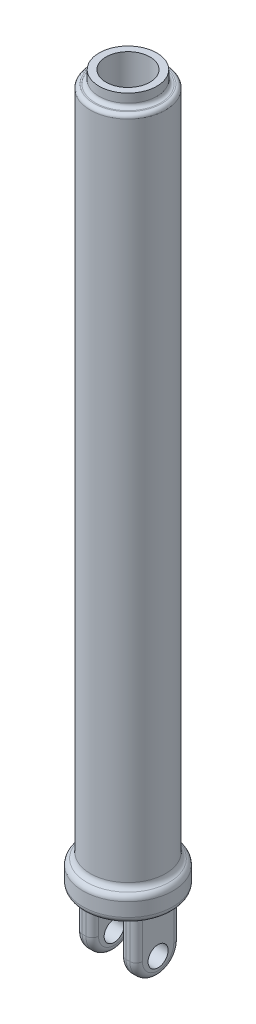
ISO-10303-21;
HEADER;
FILE_DESCRIPTION(('STEP AP214'),'2;1');
FILE_NAME('part.step','',(''),(''),'','','');
FILE_SCHEMA(('AUTOMOTIVE_DESIGN { 1 0 10303 214 1 1 1 1 }'));
ENDSEC;
DATA;
#1=APPLICATION_CONTEXT('core data for automotive mechanical design processes');
#2=APPLICATION_PROTOCOL_DEFINITION('international standard','automotive_design',2000,#1);
#3=PRODUCT_CONTEXT('',#1,'mechanical');
#4=PRODUCT('Part','Part','',(#3));
#5=PRODUCT_RELATED_PRODUCT_CATEGORY('part','',(#4));
#6=PRODUCT_DEFINITION_FORMATION('','',#4);
#7=PRODUCT_DEFINITION_CONTEXT('part definition',#1,'design');
#8=PRODUCT_DEFINITION('design','',#6,#7);
#9=PRODUCT_DEFINITION_SHAPE('','',#8);
#10=(LENGTH_UNIT() NAMED_UNIT(*) SI_UNIT(.MILLI.,.METRE.));
#11=(NAMED_UNIT(*) PLANE_ANGLE_UNIT() SI_UNIT($,.RADIAN.));
#12=(NAMED_UNIT(*) SI_UNIT($,.STERADIAN.) SOLID_ANGLE_UNIT());
#13=UNCERTAINTY_MEASURE_WITH_UNIT(LENGTH_MEASURE(1.E-05),#10,'distance_accuracy_value','');
#14=(GEOMETRIC_REPRESENTATION_CONTEXT(3) GLOBAL_UNCERTAINTY_ASSIGNED_CONTEXT((#13)) GLOBAL_UNIT_ASSIGNED_CONTEXT((#10,
#11,#12)) REPRESENTATION_CONTEXT('',''));
#15=CARTESIAN_POINT('',(0.,0.,0.));
#16=DIRECTION('',(0.,0.,1.));
#17=DIRECTION('',(1.,0.,0.));
#18=AXIS2_PLACEMENT_3D('',#15,#16,#17);
#19=CARTESIAN_POINT('',(18.9999999999999,-32.5,0.));
#20=DIRECTION('',(-1.,0.,0.));
#21=DIRECTION('',(0.,0.,1.));
#22=AXIS2_PLACEMENT_3D('',#19,#20,#21);
#23=TOROIDAL_SURFACE('',#22,12.5,5.);
#24=CARTESIAN_POINT('',(18.9999999999999,-32.5,12.4999999999999));
#25=DIRECTION('',(0.,1.,0.));
#26=DIRECTION('',(0.,0.,1.));
#27=AXIS2_PLACEMENT_3D('',#24,#25,#26);
#28=CIRCLE('',#27,4.99999999999997);
#29=CARTESIAN_POINT('',(18.9999999999999,-32.5,17.4999999999999));
#30=VERTEX_POINT('',#29);
#31=CARTESIAN_POINT('',(23.9999999999999,-32.5,12.4999999999999));
#32=VERTEX_POINT('',#31);
#33=EDGE_CURVE('E161',#30,#32,#28,.T.);
#34=ORIENTED_EDGE('',*,*,#33,.F.);
#35=CARTESIAN_POINT('',(18.9999999999999,-32.5,0.));
#36=DIRECTION('',(1.,0.,0.));
#37=DIRECTION('',(0.,0.,-1.));
#38=AXIS2_PLACEMENT_3D('',#35,#36,#37);
#39=CIRCLE('',#38,17.4999999999999);
#40=CARTESIAN_POINT('',(18.9999999999999,-32.5,-17.4999999999999));
#41=VERTEX_POINT('',#40);
#42=EDGE_CURVE('E531',#41,#30,#39,.F.);
#43=ORIENTED_EDGE('',*,*,#42,.F.);
#44=CARTESIAN_POINT('',(18.9999999999999,-32.5,-12.4999999999999));
#45=DIRECTION('',(0.,1.,0.));
#46=DIRECTION('',(0.,0.,1.));
#47=AXIS2_PLACEMENT_3D('',#44,#45,#46);
#48=CIRCLE('',#47,4.99999999999997);
#49=CARTESIAN_POINT('',(23.9999999999999,-32.5,-12.4999999999999));
#50=VERTEX_POINT('',#49);
#51=EDGE_CURVE('E556',#50,#41,#48,.T.);
#52=ORIENTED_EDGE('',*,*,#51,.F.);
#53=CARTESIAN_POINT('',(23.9999999999999,-32.5,0.));
#54=DIRECTION('',(-1.,0.,0.));
#55=DIRECTION('',(0.,0.,-1.));
#56=AXIS2_PLACEMENT_3D('',#53,#54,#55);
#57=CIRCLE('',#56,12.4999999999999);
#58=EDGE_CURVE('E164',#50,#32,#57,.T.);
#59=ORIENTED_EDGE('',*,*,#58,.T.);
#60=EDGE_LOOP('',(#34,#43,#52,#59));
#61=FACE_BOUND('',#60,.T.);
#62=ADVANCED_FACE('F16',(#61),#23,.T.);
#63=CARTESIAN_POINT('',(-35.8238545691087,-32.5,0.));
#64=DIRECTION('',(1.,0.,0.));
#65=DIRECTION('',(0.,0.,-1.));
#66=AXIS2_PLACEMENT_3D('',#63,#64,#65);
#67=CYLINDRICAL_SURFACE('',#66,17.4999999999999);
#68=DIRECTION('',(1.,0.,0.));
#69=VECTOR('',#68,1.);
#70=CARTESIAN_POINT('',(10.9999999999999,-32.5,17.4999999999999));
#71=LINE('',#70,#69);
#72=CARTESIAN_POINT('',(15.9999999999999,-32.5,17.4999999999999));
#73=VERTEX_POINT('',#72);
#74=EDGE_CURVE('E524',#30,#73,#71,.F.);
#75=ORIENTED_EDGE('',*,*,#74,.T.);
#76=CARTESIAN_POINT('',(15.9999999999999,-32.5,0.));
#77=DIRECTION('',(1.,0.,0.));
#78=DIRECTION('',(0.,0.,-1.));
#79=AXIS2_PLACEMENT_3D('',#76,#77,#78);
#80=CIRCLE('',#79,17.5);
#81=CARTESIAN_POINT('',(15.9999999999999,-32.5,-17.4999999999999));
#82=VERTEX_POINT('',#81);
#83=EDGE_CURVE('E488',#82,#73,#80,.F.);
#84=ORIENTED_EDGE('',*,*,#83,.F.);
#85=DIRECTION('',(1.,0.,0.));
#86=VECTOR('',#85,1.);
#87=CARTESIAN_POINT('',(10.9999999999999,-32.5,-17.4999999999999));
#88=LINE('',#87,#86);
#89=EDGE_CURVE('E552',#82,#41,#88,.T.);
#90=ORIENTED_EDGE('',*,*,#89,.T.);
#91=ORIENTED_EDGE('',*,*,#42,.T.);
#92=EDGE_LOOP('',(#75,#84,#90,#91));
#93=FACE_BOUND('',#92,.T.);
#94=ADVANCED_FACE('F880',(#93),#67,.T.);
#95=CARTESIAN_POINT('',(-35.8238545691087,-34.9999999999999,0.));
#96=DIRECTION('',(1.,0.,0.));
#97=DIRECTION('',(0.,0.,-1.));
#98=AXIS2_PLACEMENT_3D('',#95,#96,#97);
#99=CYLINDRICAL_SURFACE('',#98,7.99999999999995);
#100=CARTESIAN_POINT('',(10.9999999999999,-34.9999999999999,0.));
#101=DIRECTION('',(1.,0.,0.));
#102=DIRECTION('',(0.,0.,-1.));
#103=AXIS2_PLACEMENT_3D('',#100,#101,#102);
#104=CIRCLE('',#103,7.99999999999995);
#105=CARTESIAN_POINT('',(10.9999999999999,-34.9999999999999,-7.99999999999998));
#106=VERTEX_POINT('',#105);
#107=EDGE_CURVE('E200',#106,#106,#104,.F.);
#108=ORIENTED_EDGE('',*,*,#107,.T.);
#109=EDGE_LOOP('',(#108));
#110=FACE_BOUND('',#109,.T.);
#111=CARTESIAN_POINT('',(23.9999999999998,-34.9999999999999,0.));
#112=DIRECTION('',(1.,0.,0.));
#113=DIRECTION('',(0.,0.,-1.));
#114=AXIS2_PLACEMENT_3D('',#111,#112,#113);
#115=CIRCLE('',#114,7.99999999999995);
#116=CARTESIAN_POINT('',(23.9999999999998,-34.9999999999999,-7.99999999999997));
#117=VERTEX_POINT('',#116);
#118=EDGE_CURVE('E163',#117,#117,#115,.T.);
#119=ORIENTED_EDGE('',*,*,#118,.T.);
#120=EDGE_LOOP('',(#119));
#121=FACE_BOUND('',#120,.T.);
#122=ADVANCED_FACE('F873',(#110,#121),#99,.F.);
#123=CARTESIAN_POINT('',(15.9999999999999,-32.5,0.));
#124=DIRECTION('',(1.,0.,0.));
#125=DIRECTION('',(0.,0.,-1.));
#126=AXIS2_PLACEMENT_3D('',#123,#124,#125);
#127=TOROIDAL_SURFACE('',#126,12.5,5.);
#128=CARTESIAN_POINT('',(15.9999999999999,-32.5,12.4999999999999));
#129=DIRECTION('',(0.,1.,0.));
#130=DIRECTION('',(0.,0.,1.));
#131=AXIS2_PLACEMENT_3D('',#128,#129,#130);
#132=CIRCLE('',#131,4.99999999999997);
#133=CARTESIAN_POINT('',(10.9999999999999,-32.5,12.4999999999999));
#134=VERTEX_POINT('',#133);
#135=EDGE_CURVE('E517',#134,#73,#132,.T.);
#136=ORIENTED_EDGE('',*,*,#135,.F.);
#137=CARTESIAN_POINT('',(10.9999999999999,-32.5,0.));
#138=DIRECTION('',(1.,0.,0.));
#139=DIRECTION('',(0.,0.,1.));
#140=AXIS2_PLACEMENT_3D('',#137,#138,#139);
#141=CIRCLE('',#140,12.4999999999999);
#142=CARTESIAN_POINT('',(10.9999999999999,-32.5,-12.4999999999999));
#143=VERTEX_POINT('',#142);
#144=EDGE_CURVE('E521',#134,#143,#141,.T.);
#145=ORIENTED_EDGE('',*,*,#144,.T.);
#146=CARTESIAN_POINT('',(15.9999999999999,-32.5,-12.4999999999999));
#147=DIRECTION('',(0.,1.,0.));
#148=DIRECTION('',(0.,0.,1.));
#149=AXIS2_PLACEMENT_3D('',#146,#147,#148);
#150=CIRCLE('',#149,4.99999999999997);
#151=EDGE_CURVE('E204',#82,#143,#150,.T.);
#152=ORIENTED_EDGE('',*,*,#151,.F.);
#153=ORIENTED_EDGE('',*,*,#83,.T.);
#154=EDGE_LOOP('',(#136,#145,#152,#153));
#155=FACE_BOUND('',#154,.T.);
#156=ADVANCED_FACE('F501',(#155),#127,.T.);
#157=CARTESIAN_POINT('',(-15.9999999999999,-32.5,0.));
#158=DIRECTION('',(-1.,0.,0.));
#159=DIRECTION('',(0.,0.,1.));
#160=AXIS2_PLACEMENT_3D('',#157,#158,#159);
#161=TOROIDAL_SURFACE('',#160,12.5,5.);
#162=CARTESIAN_POINT('',(-15.9999999999999,-32.5,-12.4999999999999));
#163=DIRECTION('',(0.,1.,0.));
#164=DIRECTION('',(0.,0.,1.));
#165=AXIS2_PLACEMENT_3D('',#162,#163,#164);
#166=CIRCLE('',#165,4.99999999999997);
#167=CARTESIAN_POINT('',(-10.9999999999999,-32.5,-12.4999999999999));
#168=VERTEX_POINT('',#167);
#169=CARTESIAN_POINT('',(-15.9999999999999,-32.5,-17.4999999999999));
#170=VERTEX_POINT('',#169);
#171=EDGE_CURVE('E480',#168,#170,#166,.T.);
#172=ORIENTED_EDGE('',*,*,#171,.F.);
#173=CARTESIAN_POINT('',(-10.9999999999999,-32.5,0.));
#174=DIRECTION('',(-1.,0.,0.));
#175=DIRECTION('',(0.,0.,-1.));
#176=AXIS2_PLACEMENT_3D('',#173,#174,#175);
#177=CIRCLE('',#176,12.4999999999999);
#178=CARTESIAN_POINT('',(-11.,-32.5,12.4999999999999));
#179=VERTEX_POINT('',#178);
#180=EDGE_CURVE('E483',#168,#179,#177,.T.);
#181=ORIENTED_EDGE('',*,*,#180,.T.);
#182=CARTESIAN_POINT('',(-15.9999999999999,-32.5,12.4999999999999));
#183=DIRECTION('',(0.,1.,0.));
#184=DIRECTION('',(0.,0.,1.));
#185=AXIS2_PLACEMENT_3D('',#182,#183,#184);
#186=CIRCLE('',#185,4.99999999999997);
#187=CARTESIAN_POINT('',(-15.9999999999999,-32.5,17.4999999999999));
#188=VERTEX_POINT('',#187);
#189=EDGE_CURVE('E199',#188,#179,#186,.T.);
#190=ORIENTED_EDGE('',*,*,#189,.F.);
#191=CARTESIAN_POINT('',(-15.9999999999999,-32.5,0.));
#192=DIRECTION('',(1.,0.,0.));
#193=DIRECTION('',(0.,0.,-1.));
#194=AXIS2_PLACEMENT_3D('',#191,#192,#193);
#195=CIRCLE('',#194,17.4999999999999);
#196=EDGE_CURVE('E486',#170,#188,#195,.F.);
#197=ORIENTED_EDGE('',*,*,#196,.F.);
#198=EDGE_LOOP('',(#172,#181,#190,#197));
#199=FACE_BOUND('',#198,.T.);
#200=ADVANCED_FACE('F496',(#199),#161,.T.);
#201=CARTESIAN_POINT('',(-35.8238545691087,-32.5,0.));
#202=DIRECTION('',(1.,0.,0.));
#203=DIRECTION('',(0.,0.,-1.));
#204=AXIS2_PLACEMENT_3D('',#201,#202,#203);
#205=CYLINDRICAL_SURFACE('',#204,17.4999999999999);
#206=DIRECTION('',(1.,0.,0.));
#207=VECTOR('',#206,1.);
#208=CARTESIAN_POINT('',(-11.,-32.5,17.4999999999999));
#209=LINE('',#208,#207);
#210=CARTESIAN_POINT('',(-18.9999999999999,-32.5,17.4999999999999));
#211=VERTEX_POINT('',#210);
#212=EDGE_CURVE('E439',#188,#211,#209,.F.);
#213=ORIENTED_EDGE('',*,*,#212,.T.);
#214=CARTESIAN_POINT('',(-18.9999999999999,-32.5,0.));
#215=DIRECTION('',(1.,0.,0.));
#216=DIRECTION('',(0.,0.,-1.));
#217=AXIS2_PLACEMENT_3D('',#214,#215,#216);
#218=CIRCLE('',#217,17.5);
#219=CARTESIAN_POINT('',(-18.9999999999999,-32.5,-17.4999999999999));
#220=VERTEX_POINT('',#219);
#221=EDGE_CURVE('E446',#220,#211,#218,.F.);
#222=ORIENTED_EDGE('',*,*,#221,.F.);
#223=DIRECTION('',(1.,0.,0.));
#224=VECTOR('',#223,1.);
#225=CARTESIAN_POINT('',(-11.,-32.5,-17.4999999999999));
#226=LINE('',#225,#224);
#227=EDGE_CURVE('E473',#220,#170,#226,.T.);
#228=ORIENTED_EDGE('',*,*,#227,.T.);
#229=ORIENTED_EDGE('',*,*,#196,.T.);
#230=EDGE_LOOP('',(#213,#222,#228,#229));
#231=FACE_BOUND('',#230,.T.);
#232=ADVANCED_FACE('F500',(#231),#205,.T.);
#233=CARTESIAN_POINT('',(-35.8238545691087,-34.9999999999999,0.));
#234=DIRECTION('',(1.,0.,0.));
#235=DIRECTION('',(0.,0.,-1.));
#236=AXIS2_PLACEMENT_3D('',#233,#234,#235);
#237=CYLINDRICAL_SURFACE('',#236,7.99999999999995);
#238=CARTESIAN_POINT('',(-23.9999999999998,-34.9999999999999,0.));
#239=DIRECTION('',(1.,0.,0.));
#240=DIRECTION('',(0.,0.,-1.));
#241=AXIS2_PLACEMENT_3D('',#238,#239,#240);
#242=CIRCLE('',#241,7.99999999999995);
#243=CARTESIAN_POINT('',(-23.9999999999998,-34.9999999999999,-7.99999999999999));
#244=VERTEX_POINT('',#243);
#245=EDGE_CURVE('E190',#244,#244,#242,.F.);
#246=ORIENTED_EDGE('',*,*,#245,.T.);
#247=EDGE_LOOP('',(#246));
#248=FACE_BOUND('',#247,.T.);
#249=CARTESIAN_POINT('',(-11.,-34.9999999999999,0.));
#250=DIRECTION('',(1.,0.,0.));
#251=DIRECTION('',(0.,0.,-1.));
#252=AXIS2_PLACEMENT_3D('',#249,#250,#251);
#253=CIRCLE('',#252,7.99999999999995);
#254=CARTESIAN_POINT('',(-11.,-34.9999999999999,-7.99999999999998));
#255=VERTEX_POINT('',#254);
#256=EDGE_CURVE('E195',#255,#255,#253,.T.);
#257=ORIENTED_EDGE('',*,*,#256,.T.);
#258=EDGE_LOOP('',(#257));
#259=FACE_BOUND('',#258,.T.);
#260=ADVANCED_FACE('F455',(#248,#259),#237,.F.);
#261=CARTESIAN_POINT('',(-18.9999999999999,-32.5,0.));
#262=DIRECTION('',(1.,0.,0.));
#263=DIRECTION('',(0.,0.,-1.));
#264=AXIS2_PLACEMENT_3D('',#261,#262,#263);
#265=TOROIDAL_SURFACE('',#264,12.5,5.);
#266=CARTESIAN_POINT('',(-18.9999999999999,-32.5,12.4999999999999));
#267=DIRECTION('',(0.,1.,0.));
#268=DIRECTION('',(0.,0.,1.));
#269=AXIS2_PLACEMENT_3D('',#266,#267,#268);
#270=CIRCLE('',#269,4.99999999999997);
#271=CARTESIAN_POINT('',(-23.9999999999999,-32.5,12.4999999999999));
#272=VERTEX_POINT('',#271);
#273=EDGE_CURVE('E428',#272,#211,#270,.T.);
#274=ORIENTED_EDGE('',*,*,#273,.F.);
#275=CARTESIAN_POINT('',(-23.9999999999999,-32.5,0.));
#276=DIRECTION('',(1.,0.,0.));
#277=DIRECTION('',(0.,0.,1.));
#278=AXIS2_PLACEMENT_3D('',#275,#276,#277);
#279=CIRCLE('',#278,12.4999999999999);
#280=CARTESIAN_POINT('',(-23.9999999999998,-32.5,-12.4999999999999));
#281=VERTEX_POINT('',#280);
#282=EDGE_CURVE('E430',#272,#281,#279,.T.);
#283=ORIENTED_EDGE('',*,*,#282,.T.);
#284=CARTESIAN_POINT('',(-18.9999999999999,-32.5,-12.4999999999999));
#285=DIRECTION('',(0.,1.,0.));
#286=DIRECTION('',(0.,0.,1.));
#287=AXIS2_PLACEMENT_3D('',#284,#285,#286);
#288=CIRCLE('',#287,4.99999999999997);
#289=EDGE_CURVE('E194',#220,#281,#288,.T.);
#290=ORIENTED_EDGE('',*,*,#289,.F.);
#291=ORIENTED_EDGE('',*,*,#221,.T.);
#292=EDGE_LOOP('',(#274,#283,#290,#291));
#293=FACE_BOUND('',#292,.T.);
#294=ADVANCED_FACE('F449',(#293),#265,.T.);
#295=CARTESIAN_POINT('',(-17.4999999999998,40.,0.));
#296=DIRECTION('',(0.,1.,0.));
#297=DIRECTION('',(0.,0.,1.));
#298=AXIS2_PLACEMENT_3D('',#295,#296,#297);
#299=PLANE('',#298);
#300=CARTESIAN_POINT('',(0.,40.,0.));
#301=DIRECTION('',(0.,1.,0.));
#302=DIRECTION('',(0.,0.,1.));
#303=AXIS2_PLACEMENT_3D('',#300,#301,#302);
#304=CIRCLE('',#303,17.4999999999999);
#305=CARTESIAN_POINT('',(0.,40.,17.4999999999999));
#306=VERTEX_POINT('',#305);
#307=EDGE_CURVE('E182',#306,#306,#304,.T.);
#308=ORIENTED_EDGE('',*,*,#307,.T.);
#309=EDGE_LOOP('',(#308));
#310=FACE_BOUND('',#309,.T.);
#311=ADVANCED_FACE('F454',(#310),#299,.T.);
#312=CARTESIAN_POINT('',(10.9999999999999,-50.,17.4999999999999));
#313=DIRECTION('',(0.,0.,-1.));
#314=DIRECTION('',(0.,1.,0.));
#315=AXIS2_PLACEMENT_3D('',#312,#313,#314);
#316=PLANE('',#315);
#317=DIRECTION('',(0.,1.,0.));
#318=VECTOR('',#317,1.);
#319=CARTESIAN_POINT('',(18.9999999999999,-50.,17.4999999999999));
#320=LINE('',#319,#318);
#321=CARTESIAN_POINT('',(18.9999999999999,0.,17.4999999999999));
#322=VERTEX_POINT('',#321);
#323=EDGE_CURVE('E148',#322,#30,#320,.F.);
#324=ORIENTED_EDGE('',*,*,#323,.F.);
#325=DIRECTION('',(1.,0.,0.));
#326=VECTOR('',#325,1.);
#327=CARTESIAN_POINT('',(0.,0.,17.4999999999999));
#328=LINE('',#327,#326);
#329=CARTESIAN_POINT('',(15.9999999999999,0.,17.4999999999999));
#330=VERTEX_POINT('',#329);
#331=EDGE_CURVE('E180',#330,#322,#328,.T.);
#332=ORIENTED_EDGE('',*,*,#331,.F.);
#333=DIRECTION('',(0.,1.,0.));
#334=VECTOR('',#333,1.);
#335=CARTESIAN_POINT('',(15.9999999999999,-50.,17.4999999999999));
#336=LINE('',#335,#334);
#337=EDGE_CURVE('E520',#73,#330,#336,.T.);
#338=ORIENTED_EDGE('',*,*,#337,.F.);
#339=ORIENTED_EDGE('',*,*,#74,.F.);
#340=EDGE_LOOP('',(#324,#332,#338,#339));
#341=FACE_BOUND('',#340,.T.);
#342=ADVANCED_FACE('F600',(#341),#316,.F.);
#343=CARTESIAN_POINT('',(18.9999999999999,-50.,12.4999999999999));
#344=DIRECTION('',(0.,1.,0.));
#345=DIRECTION('',(0.,0.,1.));
#346=AXIS2_PLACEMENT_3D('',#343,#344,#345);
#347=CYLINDRICAL_SURFACE('',#346,4.99999999999997);
#348=CARTESIAN_POINT('',(18.9999999999999,0.,12.4999999999999));
#349=DIRECTION('',(0.,1.,0.));
#350=DIRECTION('',(0.,0.,1.));
#351=AXIS2_PLACEMENT_3D('',#348,#349,#350);
#352=CIRCLE('',#351,4.99999999999997);
#353=CARTESIAN_POINT('',(23.9999999999998,0.,12.4999999999999));
#354=VERTEX_POINT('',#353);
#355=EDGE_CURVE('E158',#322,#354,#352,.T.);
#356=ORIENTED_EDGE('',*,*,#355,.F.);
#357=ORIENTED_EDGE('',*,*,#323,.T.);
#358=ORIENTED_EDGE('',*,*,#33,.T.);
#359=DIRECTION('',(0.,1.,0.));
#360=VECTOR('',#359,1.);
#361=CARTESIAN_POINT('',(23.9999999999998,-50.,12.4999999999999));
#362=LINE('',#361,#360);
#363=EDGE_CURVE('E154',#32,#354,#362,.T.);
#364=ORIENTED_EDGE('',*,*,#363,.T.);
#365=EDGE_LOOP('',(#356,#357,#358,#364));
#366=FACE_BOUND('',#365,.T.);
#367=ADVANCED_FACE('F156',(#366),#347,.T.);
#368=CARTESIAN_POINT('',(23.9999999999998,-50.,17.4999999999999));
#369=DIRECTION('',(-1.,0.,0.));
#370=DIRECTION('',(0.,0.,1.));
#371=AXIS2_PLACEMENT_3D('',#368,#369,#370);
#372=PLANE('',#371);
#373=ORIENTED_EDGE('',*,*,#118,.F.);
#374=EDGE_LOOP('',(#373));
#375=FACE_BOUND('',#374,.T.);
#376=ORIENTED_EDGE('',*,*,#363,.F.);
#377=ORIENTED_EDGE('',*,*,#58,.F.);
#378=DIRECTION('',(0.,1.,0.));
#379=VECTOR('',#378,1.);
#380=CARTESIAN_POINT('',(23.9999999999999,-50.,-12.4999999999999));
#381=LINE('',#380,#379);
#382=CARTESIAN_POINT('',(23.9999999999998,0.,-12.4999999999999));
#383=VERTEX_POINT('',#382);
#384=EDGE_CURVE('E170',#383,#50,#381,.F.);
#385=ORIENTED_EDGE('',*,*,#384,.F.);
#386=DIRECTION('',(0.,0.,-1.));
#387=VECTOR('',#386,1.);
#388=CARTESIAN_POINT('',(23.9999999999998,0.,0.));
#389=LINE('',#388,#387);
#390=EDGE_CURVE('E167',#354,#383,#389,.T.);
#391=ORIENTED_EDGE('',*,*,#390,.F.);
#392=EDGE_LOOP('',(#376,#377,#385,#391));
#393=FACE_BOUND('',#392,.T.);
#394=ADVANCED_FACE('F168',(#375,#393),#372,.F.);
#395=CARTESIAN_POINT('',(18.9999999999999,-50.,-12.4999999999999));
#396=DIRECTION('',(0.,1.,0.));
#397=DIRECTION('',(0.,0.,1.));
#398=AXIS2_PLACEMENT_3D('',#395,#396,#397);
#399=CYLINDRICAL_SURFACE('',#398,4.99999999999997);
#400=ORIENTED_EDGE('',*,*,#51,.T.);
#401=DIRECTION('',(0.,-1.,0.));
#402=VECTOR('',#401,1.);
#403=CARTESIAN_POINT('',(18.9999999999999,-50.,-17.4999999999999));
#404=LINE('',#403,#402);
#405=CARTESIAN_POINT('',(18.9999999999999,0.,-17.4999999999999));
#406=VERTEX_POINT('',#405);
#407=EDGE_CURVE('E555',#41,#406,#404,.F.);
#408=ORIENTED_EDGE('',*,*,#407,.T.);
#409=CARTESIAN_POINT('',(18.9999999999999,0.,-12.4999999999999));
#410=DIRECTION('',(0.,1.,0.));
#411=DIRECTION('',(0.,0.,1.));
#412=AXIS2_PLACEMENT_3D('',#409,#410,#411);
#413=CIRCLE('',#412,4.99999999999997);
#414=EDGE_CURVE('E174',#383,#406,#413,.T.);
#415=ORIENTED_EDGE('',*,*,#414,.F.);
#416=ORIENTED_EDGE('',*,*,#384,.T.);
#417=EDGE_LOOP('',(#400,#408,#415,#416));
#418=FACE_BOUND('',#417,.T.);
#419=ADVANCED_FACE('F596',(#418),#399,.T.);
#420=CARTESIAN_POINT('',(10.9999999999999,-50.,-17.4999999999999));
#421=DIRECTION('',(0.,0.,1.));
#422=DIRECTION('',(0.,-1.,0.));
#423=AXIS2_PLACEMENT_3D('',#420,#421,#422);
#424=PLANE('',#423);
#425=ORIENTED_EDGE('',*,*,#407,.F.);
#426=ORIENTED_EDGE('',*,*,#89,.F.);
#427=DIRECTION('',(0.,1.,0.));
#428=VECTOR('',#427,1.);
#429=CARTESIAN_POINT('',(15.9999999999999,-50.,-17.4999999999999));
#430=LINE('',#429,#428);
#431=CARTESIAN_POINT('',(15.9999999999999,0.,-17.4999999999999));
#432=VERTEX_POINT('',#431);
#433=EDGE_CURVE('E549',#432,#82,#430,.F.);
#434=ORIENTED_EDGE('',*,*,#433,.F.);
#435=DIRECTION('',(1.,0.,0.));
#436=VECTOR('',#435,1.);
#437=CARTESIAN_POINT('',(0.,0.,-17.4999999999999));
#438=LINE('',#437,#436);
#439=EDGE_CURVE('E355',#406,#432,#438,.F.);
#440=ORIENTED_EDGE('',*,*,#439,.F.);
#441=EDGE_LOOP('',(#425,#426,#434,#440));
#442=FACE_BOUND('',#441,.T.);
#443=ADVANCED_FACE('F807',(#442),#424,.F.);
#444=CARTESIAN_POINT('',(15.9999999999999,-50.,-12.4999999999999));
#445=DIRECTION('',(0.,1.,0.));
#446=DIRECTION('',(0.,0.,1.));
#447=AXIS2_PLACEMENT_3D('',#444,#445,#446);
#448=CYLINDRICAL_SURFACE('',#447,4.99999999999997);
#449=ORIENTED_EDGE('',*,*,#151,.T.);
#450=DIRECTION('',(0.,1.,0.));
#451=VECTOR('',#450,1.);
#452=CARTESIAN_POINT('',(10.9999999999999,-50.,-12.4999999999999));
#453=LINE('',#452,#451);
#454=CARTESIAN_POINT('',(10.9999999999999,0.,-12.4999999999999));
#455=VERTEX_POINT('',#454);
#456=EDGE_CURVE('E203',#143,#455,#453,.T.);
#457=ORIENTED_EDGE('',*,*,#456,.T.);
#458=CARTESIAN_POINT('',(15.9999999999999,0.,-12.4999999999999));
#459=DIRECTION('',(0.,1.,0.));
#460=DIRECTION('',(0.,0.,1.));
#461=AXIS2_PLACEMENT_3D('',#458,#459,#460);
#462=CIRCLE('',#461,4.99999999999997);
#463=EDGE_CURVE('E353',#432,#455,#462,.T.);
#464=ORIENTED_EDGE('',*,*,#463,.F.);
#465=ORIENTED_EDGE('',*,*,#433,.T.);
#466=EDGE_LOOP('',(#449,#457,#464,#465));
#467=FACE_BOUND('',#466,.T.);
#468=ADVANCED_FACE('F798',(#467),#448,.T.);
#469=CARTESIAN_POINT('',(10.9999999999999,-50.,17.4999999999999));
#470=DIRECTION('',(1.,0.,0.));
#471=DIRECTION('',(0.,0.,-1.));
#472=AXIS2_PLACEMENT_3D('',#469,#470,#471);
#473=PLANE('',#472);
#474=DIRECTION('',(0.,1.,0.));
#475=VECTOR('',#474,1.);
#476=CARTESIAN_POINT('',(10.9999999999999,-50.,12.4999999999999));
#477=LINE('',#476,#475);
#478=CARTESIAN_POINT('',(10.9999999999999,0.,12.4999999999999));
#479=VERTEX_POINT('',#478);
#480=EDGE_CURVE('E441',#479,#134,#477,.F.);
#481=ORIENTED_EDGE('',*,*,#480,.F.);
#482=DIRECTION('',(0.,0.,-1.));
#483=VECTOR('',#482,1.);
#484=CARTESIAN_POINT('',(10.9999999999999,0.,0.));
#485=LINE('',#484,#483);
#486=EDGE_CURVE('E352',#455,#479,#485,.F.);
#487=ORIENTED_EDGE('',*,*,#486,.F.);
#488=ORIENTED_EDGE('',*,*,#456,.F.);
#489=ORIENTED_EDGE('',*,*,#144,.F.);
#490=EDGE_LOOP('',(#481,#487,#488,#489));
#491=FACE_BOUND('',#490,.T.);
#492=ORIENTED_EDGE('',*,*,#107,.F.);
#493=EDGE_LOOP('',(#492));
#494=FACE_BOUND('',#493,.T.);
#495=ADVANCED_FACE('F789',(#491,#494),#473,.F.);
#496=CARTESIAN_POINT('',(15.9999999999999,-50.,12.4999999999999));
#497=DIRECTION('',(0.,1.,0.));
#498=DIRECTION('',(0.,0.,1.));
#499=AXIS2_PLACEMENT_3D('',#496,#497,#498);
#500=CYLINDRICAL_SURFACE('',#499,4.99999999999997);
#501=CARTESIAN_POINT('',(15.9999999999999,0.,12.4999999999999));
#502=DIRECTION('',(0.,1.,0.));
#503=DIRECTION('',(0.,0.,1.));
#504=AXIS2_PLACEMENT_3D('',#501,#502,#503);
#505=CIRCLE('',#504,4.99999999999997);
#506=EDGE_CURVE('E351',#479,#330,#505,.T.);
#507=ORIENTED_EDGE('',*,*,#506,.F.);
#508=ORIENTED_EDGE('',*,*,#480,.T.);
#509=ORIENTED_EDGE('',*,*,#135,.T.);
#510=ORIENTED_EDGE('',*,*,#337,.T.);
#511=EDGE_LOOP('',(#507,#508,#509,#510));
#512=FACE_BOUND('',#511,.T.);
#513=ADVANCED_FACE('F781',(#512),#500,.T.);
#514=CARTESIAN_POINT('',(-11.,-50.,17.4999999999999));
#515=DIRECTION('',(0.,0.,-1.));
#516=DIRECTION('',(0.,1.,0.));
#517=AXIS2_PLACEMENT_3D('',#514,#515,#516);
#518=PLANE('',#517);
#519=DIRECTION('',(0.,1.,0.));
#520=VECTOR('',#519,1.);
#521=CARTESIAN_POINT('',(-15.9999999999999,-50.,17.4999999999999));
#522=LINE('',#521,#520);
#523=CARTESIAN_POINT('',(-15.9999999999999,0.,17.4999999999999));
#524=VERTEX_POINT('',#523);
#525=EDGE_CURVE('E424',#524,#188,#522,.F.);
#526=ORIENTED_EDGE('',*,*,#525,.F.);
#527=DIRECTION('',(1.,0.,0.));
#528=VECTOR('',#527,1.);
#529=CARTESIAN_POINT('',(0.,0.,17.4999999999999));
#530=LINE('',#529,#528);
#531=CARTESIAN_POINT('',(-18.9999999999999,0.,17.4999999999999));
#532=VERTEX_POINT('',#531);
#533=EDGE_CURVE('E350',#532,#524,#530,.T.);
#534=ORIENTED_EDGE('',*,*,#533,.F.);
#535=DIRECTION('',(0.,1.,0.));
#536=VECTOR('',#535,1.);
#537=CARTESIAN_POINT('',(-18.9999999999999,-50.,17.4999999999999));
#538=LINE('',#537,#536);
#539=EDGE_CURVE('E366',#211,#532,#538,.T.);
#540=ORIENTED_EDGE('',*,*,#539,.F.);
#541=ORIENTED_EDGE('',*,*,#212,.F.);
#542=EDGE_LOOP('',(#526,#534,#540,#541));
#543=FACE_BOUND('',#542,.T.);
#544=ADVANCED_FACE('F420',(#543),#518,.F.);
#545=CARTESIAN_POINT('',(-15.9999999999999,-50.,12.4999999999999));
#546=DIRECTION('',(0.,1.,0.));
#547=DIRECTION('',(0.,0.,1.));
#548=AXIS2_PLACEMENT_3D('',#545,#546,#547);
#549=CYLINDRICAL_SURFACE('',#548,4.99999999999997);
#550=ORIENTED_EDGE('',*,*,#189,.T.);
#551=DIRECTION('',(0.,1.,0.));
#552=VECTOR('',#551,1.);
#553=CARTESIAN_POINT('',(-11.,-50.,12.4999999999998));
#554=LINE('',#553,#552);
#555=CARTESIAN_POINT('',(-11.,0.,12.4999999999999));
#556=VERTEX_POINT('',#555);
#557=EDGE_CURVE('E198',#179,#556,#554,.T.);
#558=ORIENTED_EDGE('',*,*,#557,.T.);
#559=CARTESIAN_POINT('',(-15.9999999999999,0.,12.4999999999999));
#560=DIRECTION('',(0.,1.,0.));
#561=DIRECTION('',(0.,0.,1.));
#562=AXIS2_PLACEMENT_3D('',#559,#560,#561);
#563=CIRCLE('',#562,4.99999999999997);
#564=EDGE_CURVE('E347',#524,#556,#563,.T.);
#565=ORIENTED_EDGE('',*,*,#564,.F.);
#566=ORIENTED_EDGE('',*,*,#525,.T.);
#567=EDGE_LOOP('',(#550,#558,#565,#566));
#568=FACE_BOUND('',#567,.T.);
#569=ADVANCED_FACE('F764',(#568),#549,.T.);
#570=CARTESIAN_POINT('',(-11.,-50.,17.4999999999999));
#571=DIRECTION('',(-1.,0.,0.));
#572=DIRECTION('',(0.,0.,1.));
#573=AXIS2_PLACEMENT_3D('',#570,#571,#572);
#574=PLANE('',#573);
#575=DIRECTION('',(0.,1.,0.));
#576=VECTOR('',#575,1.);
#577=CARTESIAN_POINT('',(-10.9999999999999,-50.,-12.4999999999999));
#578=LINE('',#577,#576);
#579=CARTESIAN_POINT('',(-10.9999999999999,0.,-12.4999999999999));
#580=VERTEX_POINT('',#579);
#581=EDGE_CURVE('E477',#580,#168,#578,.F.);
#582=ORIENTED_EDGE('',*,*,#581,.F.);
#583=DIRECTION('',(0.,0.,-1.));
#584=VECTOR('',#583,1.);
#585=CARTESIAN_POINT('',(-10.9999999999999,0.,0.));
#586=LINE('',#585,#584);
#587=EDGE_CURVE('E346',#556,#580,#586,.T.);
#588=ORIENTED_EDGE('',*,*,#587,.F.);
#589=ORIENTED_EDGE('',*,*,#557,.F.);
#590=ORIENTED_EDGE('',*,*,#180,.F.);
#591=EDGE_LOOP('',(#582,#588,#589,#590));
#592=FACE_BOUND('',#591,.T.);
#593=ORIENTED_EDGE('',*,*,#256,.F.);
#594=EDGE_LOOP('',(#593));
#595=FACE_BOUND('',#594,.T.);
#596=ADVANCED_FACE('F755',(#592,#595),#574,.F.);
#597=CARTESIAN_POINT('',(-15.9999999999999,-50.,-12.4999999999999));
#598=DIRECTION('',(0.,1.,0.));
#599=DIRECTION('',(0.,0.,1.));
#600=AXIS2_PLACEMENT_3D('',#597,#598,#599);
#601=CYLINDRICAL_SURFACE('',#600,4.99999999999997);
#602=CARTESIAN_POINT('',(-15.9999999999999,0.,-12.4999999999999));
#603=DIRECTION('',(0.,1.,0.));
#604=DIRECTION('',(0.,0.,1.));
#605=AXIS2_PLACEMENT_3D('',#602,#603,#604);
#606=CIRCLE('',#605,4.99999999999997);
#607=CARTESIAN_POINT('',(-15.9999999999999,0.,-17.4999999999999));
#608=VERTEX_POINT('',#607);
#609=EDGE_CURVE('E343',#580,#608,#606,.T.);
#610=ORIENTED_EDGE('',*,*,#609,.F.);
#611=ORIENTED_EDGE('',*,*,#581,.T.);
#612=ORIENTED_EDGE('',*,*,#171,.T.);
#613=DIRECTION('',(0.,1.,0.));
#614=VECTOR('',#613,1.);
#615=CARTESIAN_POINT('',(-15.9999999999999,-50.,-17.4999999999999));
#616=LINE('',#615,#614);
#617=EDGE_CURVE('E476',#170,#608,#616,.T.);
#618=ORIENTED_EDGE('',*,*,#617,.T.);
#619=EDGE_LOOP('',(#610,#611,#612,#618));
#620=FACE_BOUND('',#619,.T.);
#621=ADVANCED_FACE('F746',(#620),#601,.T.);
#622=CARTESIAN_POINT('',(-11.,-50.,-17.4999999999999));
#623=DIRECTION('',(0.,0.,1.));
#624=DIRECTION('',(1.,0.,0.));
#625=AXIS2_PLACEMENT_3D('',#622,#623,#624);
#626=PLANE('',#625);
#627=ORIENTED_EDGE('',*,*,#617,.F.);
#628=ORIENTED_EDGE('',*,*,#227,.F.);
#629=DIRECTION('',(0.,1.,0.));
#630=VECTOR('',#629,1.);
#631=CARTESIAN_POINT('',(-18.9999999999999,-50.,-17.4999999999999));
#632=LINE('',#631,#630);
#633=CARTESIAN_POINT('',(-18.9999999999999,0.,-17.4999999999999));
#634=VERTEX_POINT('',#633);
#635=EDGE_CURVE('E470',#634,#220,#632,.F.);
#636=ORIENTED_EDGE('',*,*,#635,.F.);
#637=DIRECTION('',(1.,0.,0.));
#638=VECTOR('',#637,1.);
#639=CARTESIAN_POINT('',(0.,0.,-17.4999999999999));
#640=LINE('',#639,#638);
#641=EDGE_CURVE('E342',#608,#634,#640,.F.);
#642=ORIENTED_EDGE('',*,*,#641,.F.);
#643=EDGE_LOOP('',(#627,#628,#636,#642));
#644=FACE_BOUND('',#643,.T.);
#645=ADVANCED_FACE('F737',(#644),#626,.F.);
#646=CARTESIAN_POINT('',(-18.9999999999999,-50.,-12.4999999999999));
#647=DIRECTION('',(0.,1.,0.));
#648=DIRECTION('',(0.,0.,1.));
#649=AXIS2_PLACEMENT_3D('',#646,#647,#648);
#650=CYLINDRICAL_SURFACE('',#649,4.99999999999997);
#651=ORIENTED_EDGE('',*,*,#289,.T.);
#652=DIRECTION('',(0.,1.,0.));
#653=VECTOR('',#652,1.);
#654=CARTESIAN_POINT('',(-23.9999999999998,-50.,-12.4999999999999));
#655=LINE('',#654,#653);
#656=CARTESIAN_POINT('',(-23.9999999999998,0.,-12.4999999999999));
#657=VERTEX_POINT('',#656);
#658=EDGE_CURVE('E193',#281,#657,#655,.T.);
#659=ORIENTED_EDGE('',*,*,#658,.T.);
#660=CARTESIAN_POINT('',(-18.9999999999999,0.,-12.4999999999999));
#661=DIRECTION('',(0.,1.,0.));
#662=DIRECTION('',(0.,0.,1.));
#663=AXIS2_PLACEMENT_3D('',#660,#661,#662);
#664=CIRCLE('',#663,4.99999999999997);
#665=EDGE_CURVE('E339',#634,#657,#664,.T.);
#666=ORIENTED_EDGE('',*,*,#665,.F.);
#667=ORIENTED_EDGE('',*,*,#635,.T.);
#668=EDGE_LOOP('',(#651,#659,#666,#667));
#669=FACE_BOUND('',#668,.T.);
#670=ADVANCED_FACE('F728',(#669),#650,.T.);
#671=CARTESIAN_POINT('',(-23.9999999999998,-50.,17.4999999999999));
#672=DIRECTION('',(1.,0.,0.));
#673=DIRECTION('',(0.,0.,-1.));
#674=AXIS2_PLACEMENT_3D('',#671,#672,#673);
#675=PLANE('',#674);
#676=DIRECTION('',(0.,1.,0.));
#677=VECTOR('',#676,1.);
#678=CARTESIAN_POINT('',(-23.9999999999999,-50.,12.4999999999999));
#679=LINE('',#678,#677);
#680=CARTESIAN_POINT('',(-23.9999999999999,0.,12.4999999999999));
#681=VERTEX_POINT('',#680);
#682=EDGE_CURVE('E189',#681,#272,#679,.F.);
#683=ORIENTED_EDGE('',*,*,#682,.F.);
#684=DIRECTION('',(0.,0.,-1.));
#685=VECTOR('',#684,1.);
#686=CARTESIAN_POINT('',(-23.9999999999998,0.,0.));
#687=LINE('',#686,#685);
#688=EDGE_CURVE('E334',#657,#681,#687,.F.);
#689=ORIENTED_EDGE('',*,*,#688,.F.);
#690=ORIENTED_EDGE('',*,*,#658,.F.);
#691=ORIENTED_EDGE('',*,*,#282,.F.);
#692=EDGE_LOOP('',(#683,#689,#690,#691));
#693=FACE_BOUND('',#692,.T.);
#694=ORIENTED_EDGE('',*,*,#245,.F.);
#695=EDGE_LOOP('',(#694));
#696=FACE_BOUND('',#695,.T.);
#697=ADVANCED_FACE('F721',(#693,#696),#675,.F.);
#698=CARTESIAN_POINT('',(-18.9999999999999,-50.,12.4999999999999));
#699=DIRECTION('',(0.,1.,0.));
#700=DIRECTION('',(0.,0.,1.));
#701=AXIS2_PLACEMENT_3D('',#698,#699,#700);
#702=CYLINDRICAL_SURFACE('',#701,4.99999999999997);
#703=CARTESIAN_POINT('',(-18.9999999999999,0.,12.4999999999999));
#704=DIRECTION('',(0.,1.,0.));
#705=DIRECTION('',(0.,0.,1.));
#706=AXIS2_PLACEMENT_3D('',#703,#704,#705);
#707=CIRCLE('',#706,4.99999999999997);
#708=EDGE_CURVE('E329',#681,#532,#707,.T.);
#709=ORIENTED_EDGE('',*,*,#708,.F.);
#710=ORIENTED_EDGE('',*,*,#682,.T.);
#711=ORIENTED_EDGE('',*,*,#273,.T.);
#712=ORIENTED_EDGE('',*,*,#539,.T.);
#713=EDGE_LOOP('',(#709,#710,#711,#712));
#714=FACE_BOUND('',#713,.T.);
#715=ADVANCED_FACE('F426',(#714),#702,.T.);
#716=CARTESIAN_POINT('',(0.,40.,0.));
#717=DIRECTION('',(0.,1.,0.));
#718=DIRECTION('',(0.,0.,1.));
#719=AXIS2_PLACEMENT_3D('',#716,#717,#718);
#720=CYLINDRICAL_SURFACE('',#719,17.4999999999999);
#721=CARTESIAN_POINT('',(0.,565.,0.));
#722=DIRECTION('',(0.,1.,0.));
#723=DIRECTION('',(0.,0.,1.));
#724=AXIS2_PLACEMENT_3D('',#721,#722,#723);
#725=CIRCLE('',#724,17.4999999999999);
#726=CARTESIAN_POINT('',(0.,565.,17.4999999999999));
#727=VERTEX_POINT('',#726);
#728=EDGE_CURVE('E326',#727,#727,#725,.F.);
#729=ORIENTED_EDGE('',*,*,#728,.F.);
#730=EDGE_LOOP('',(#729));
#731=FACE_BOUND('',#730,.T.);
#732=ORIENTED_EDGE('',*,*,#307,.F.);
#733=EDGE_LOOP('',(#732));
#734=FACE_BOUND('',#733,.T.);
#735=ADVANCED_FACE('F397',(#731,#734),#720,.F.);
#736=CARTESIAN_POINT('',(0.,0.,0.));
#737=DIRECTION('',(0.,-1.,0.));
#738=DIRECTION('',(0.,0.,-1.));
#739=AXIS2_PLACEMENT_3D('',#736,#737,#738);
#740=PLANE('',#739);
#741=ORIENTED_EDGE('',*,*,#688,.T.);
#742=ORIENTED_EDGE('',*,*,#708,.T.);
#743=ORIENTED_EDGE('',*,*,#533,.T.);
#744=ORIENTED_EDGE('',*,*,#564,.T.);
#745=ORIENTED_EDGE('',*,*,#587,.T.);
#746=ORIENTED_EDGE('',*,*,#609,.T.);
#747=ORIENTED_EDGE('',*,*,#641,.T.);
#748=ORIENTED_EDGE('',*,*,#665,.T.);
#749=EDGE_LOOP('',(#741,#742,#743,#744,#745,#746,#747,#748));
#750=FACE_BOUND('',#749,.T.);
#751=ORIENTED_EDGE('',*,*,#486,.T.);
#752=ORIENTED_EDGE('',*,*,#506,.T.);
#753=ORIENTED_EDGE('',*,*,#331,.T.);
#754=ORIENTED_EDGE('',*,*,#355,.T.);
#755=ORIENTED_EDGE('',*,*,#390,.T.);
#756=ORIENTED_EDGE('',*,*,#414,.T.);
#757=ORIENTED_EDGE('',*,*,#439,.T.);
#758=ORIENTED_EDGE('',*,*,#463,.T.);
#759=EDGE_LOOP('',(#751,#752,#753,#754,#755,#756,#757,#758));
#760=FACE_BOUND('',#759,.T.);
#761=CARTESIAN_POINT('',(0.,-1.05818132034585E-13,0.));
#762=DIRECTION('',(0.,1.,0.));
#763=DIRECTION('',(0.,0.,1.));
#764=AXIS2_PLACEMENT_3D('',#761,#762,#763);
#765=CIRCLE('',#764,30.8238545691088);
#766=CARTESIAN_POINT('',(0.,0.,30.8238545691087));
#767=VERTEX_POINT('',#766);
#768=CARTESIAN_POINT('',(0.,0.,-30.8238545691088));
#769=VERTEX_POINT('',#768);
#770=EDGE_CURVE('E323',#767,#769,#765,.T.);
#771=ORIENTED_EDGE('',*,*,#770,.F.);
#772=CARTESIAN_POINT('',(0.,-1.05818132034585E-13,0.));
#773=DIRECTION('',(0.,1.,0.));
#774=DIRECTION('',(0.,0.,-1.));
#775=AXIS2_PLACEMENT_3D('',#772,#773,#774);
#776=CIRCLE('',#775,30.8238545691088);
#777=EDGE_CURVE('E321',#769,#767,#776,.T.);
#778=ORIENTED_EDGE('',*,*,#777,.F.);
#779=EDGE_LOOP('',(#771,#778));
#780=FACE_BOUND('',#779,.T.);
#781=ADVANCED_FACE('F177',(#750,#760,#780),#740,.T.);
#782=CARTESIAN_POINT('',(-17.4999999999999,565.,0.));
#783=DIRECTION('',(0.,1.,0.));
#784=DIRECTION('',(0.,0.,1.));
#785=AXIS2_PLACEMENT_3D('',#782,#783,#784);
#786=PLANE('',#785);
#787=ORIENTED_EDGE('',*,*,#728,.T.);
#788=EDGE_LOOP('',(#787));
#789=FACE_BOUND('',#788,.T.);
#790=CARTESIAN_POINT('',(0.,565.,0.));
#791=DIRECTION('',(0.,1.,0.));
#792=DIRECTION('',(0.,0.,1.));
#793=AXIS2_PLACEMENT_3D('',#790,#791,#792);
#794=CIRCLE('',#793,22.9999999999998);
#795=CARTESIAN_POINT('',(0.,565.,22.9999999999998));
#796=VERTEX_POINT('',#795);
#797=EDGE_CURVE('E327',#796,#796,#794,.F.);
#798=ORIENTED_EDGE('',*,*,#797,.F.);
#799=EDGE_LOOP('',(#798));
#800=FACE_BOUND('',#799,.T.);
#801=ADVANCED_FACE('F378',(#789,#800),#786,.T.);
#802=CARTESIAN_POINT('',(0.,4.99999999999989,0.));
#803=DIRECTION('',(0.,1.,0.));
#804=DIRECTION('',(0.,0.,1.));
#805=AXIS2_PLACEMENT_3D('',#802,#803,#804);
#806=TOROIDAL_SURFACE('',#805,30.8238545691088,5.);
#807=CARTESIAN_POINT('',(0.,4.99999999999989,0.));
#808=DIRECTION('',(0.,1.,0.));
#809=DIRECTION('',(0.,0.,1.));
#810=AXIS2_PLACEMENT_3D('',#807,#808,#809);
#811=CIRCLE('',#810,35.8238545691086);
#812=CARTESIAN_POINT('',(0.,4.99999999999989,35.8238545691086));
#813=VERTEX_POINT('',#812);
#814=EDGE_CURVE('E628',#813,#813,#811,.T.);
#815=ORIENTED_EDGE('',*,*,#814,.F.);
#816=EDGE_LOOP('',(#815));
#817=FACE_BOUND('',#816,.T.);
#818=ORIENTED_EDGE('',*,*,#770,.T.);
#819=ORIENTED_EDGE('',*,*,#777,.T.);
#820=EDGE_LOOP('',(#818,#819));
#821=FACE_BOUND('',#820,.T.);
#822=ADVANCED_FACE('F322',(#817,#821),#806,.T.);
#823=CARTESIAN_POINT('',(0.,40.,0.));
#824=DIRECTION('',(0.,1.,0.));
#825=DIRECTION('',(0.,0.,1.));
#826=AXIS2_PLACEMENT_3D('',#823,#824,#825);
#827=CYLINDRICAL_SURFACE('',#826,22.9999999999998);
#828=CARTESIAN_POINT('',(0.,558.,0.));
#829=DIRECTION('',(0.,1.,0.));
#830=DIRECTION('',(0.,0.,1.));
#831=AXIS2_PLACEMENT_3D('',#828,#829,#830);
#832=CIRCLE('',#831,22.9999999999999);
#833=CARTESIAN_POINT('',(0.,558.,22.9999999999999));
#834=VERTEX_POINT('',#833);
#835=EDGE_CURVE('E296',#834,#834,#832,.T.);
#836=ORIENTED_EDGE('',*,*,#835,.T.);
#837=EDGE_LOOP('',(#836));
#838=FACE_BOUND('',#837,.T.);
#839=ORIENTED_EDGE('',*,*,#797,.T.);
#840=EDGE_LOOP('',(#839));
#841=FACE_BOUND('',#840,.T.);
#842=ADVANCED_FACE('F377',(#838,#841),#827,.T.);
#843=CARTESIAN_POINT('',(0.,40.,0.));
#844=DIRECTION('',(0.,1.,0.));
#845=DIRECTION('',(0.,0.,1.));
#846=AXIS2_PLACEMENT_3D('',#843,#844,#845);
#847=CYLINDRICAL_SURFACE('',#846,35.8238545691086);
#848=CARTESIAN_POINT('',(0.,15.891115505243,0.));
#849=DIRECTION('',(0.,1.,0.));
#850=DIRECTION('',(0.,0.,1.));
#851=AXIS2_PLACEMENT_3D('',#848,#849,#850);
#852=CIRCLE('',#851,35.8238545691088);
#853=CARTESIAN_POINT('',(0.,15.891115505243,35.8238545691088));
#854=VERTEX_POINT('',#853);
#855=EDGE_CURVE('E292',#854,#854,#852,.T.);
#856=ORIENTED_EDGE('',*,*,#855,.F.);
#857=EDGE_LOOP('',(#856));
#858=FACE_BOUND('',#857,.T.);
#859=ORIENTED_EDGE('',*,*,#814,.T.);
#860=EDGE_LOOP('',(#859));
#861=FACE_BOUND('',#860,.T.);
#862=ADVANCED_FACE('F304',(#858,#861),#847,.T.);
#863=CARTESIAN_POINT('',(0.,558.,0.));
#864=DIRECTION('',(0.,1.,0.));
#865=DIRECTION('',(0.,0.,1.));
#866=AXIS2_PLACEMENT_3D('',#863,#864,#865);
#867=TOROIDAL_SURFACE('',#866,26.,3.00000000000011);
#868=CARTESIAN_POINT('',(0.,555.,0.));
#869=DIRECTION('',(0.,1.,0.));
#870=DIRECTION('',(0.,0.,-1.));
#871=AXIS2_PLACEMENT_3D('',#868,#869,#870);
#872=CIRCLE('',#871,25.9999999999999);
#873=CARTESIAN_POINT('',(0.,555.,25.9999999999999));
#874=VERTEX_POINT('',#873);
#875=CARTESIAN_POINT('',(0.,555.,-25.9999999999999));
#876=VERTEX_POINT('',#875);
#877=EDGE_CURVE('E274',#874,#876,#872,.F.);
#878=ORIENTED_EDGE('',*,*,#877,.F.);
#879=CARTESIAN_POINT('',(0.,555.,0.));
#880=DIRECTION('',(0.,1.,0.));
#881=DIRECTION('',(0.,0.,1.));
#882=AXIS2_PLACEMENT_3D('',#879,#880,#881);
#883=CIRCLE('',#882,25.9999999999999);
#884=EDGE_CURVE('E295',#876,#874,#883,.F.);
#885=ORIENTED_EDGE('',*,*,#884,.F.);
#886=EDGE_LOOP('',(#878,#885));
#887=FACE_BOUND('',#886,.T.);
#888=ORIENTED_EDGE('',*,*,#835,.F.);
#889=EDGE_LOOP('',(#888));
#890=FACE_BOUND('',#889,.T.);
#891=ADVANCED_FACE('F300',(#887,#890),#867,.F.);
#892=CARTESIAN_POINT('',(0.,15.891115505243,0.));
#893=DIRECTION('',(0.,1.,0.));
#894=DIRECTION('',(0.,0.,1.));
#895=AXIS2_PLACEMENT_3D('',#892,#893,#894);
#896=TOROIDAL_SURFACE('',#895,30.8238545691088,5.);
#897=CARTESIAN_POINT('',(0.,20.434236936045,0.));
#898=DIRECTION('',(0.,1.,0.));
#899=DIRECTION('',(0.,0.,1.));
#900=AXIS2_PLACEMENT_3D('',#897,#898,#899);
#901=CIRCLE('',#900,32.9119272845544);
#902=CARTESIAN_POINT('',(0.,20.434236936045,32.9119272845544));
#903=VERTEX_POINT('',#902);
#904=EDGE_CURVE('E235',#903,#903,#901,.F.);
#905=ORIENTED_EDGE('',*,*,#904,.T.);
#906=EDGE_LOOP('',(#905));
#907=FACE_BOUND('',#906,.T.);
#908=ORIENTED_EDGE('',*,*,#855,.T.);
#909=EDGE_LOOP('',(#908));
#910=FACE_BOUND('',#909,.T.);
#911=ADVANCED_FACE('F252',(#907,#910),#896,.T.);
#912=CARTESIAN_POINT('',(-26.9999999999998,555.,0.));
#913=DIRECTION('',(0.,1.,0.));
#914=DIRECTION('',(0.,0.,1.));
#915=AXIS2_PLACEMENT_3D('',#912,#913,#914);
#916=PLANE('',#915);
#917=ORIENTED_EDGE('',*,*,#884,.T.);
#918=ORIENTED_EDGE('',*,*,#877,.T.);
#919=EDGE_LOOP('',(#917,#918));
#920=FACE_BOUND('',#919,.T.);
#921=CARTESIAN_POINT('',(0.,555.,0.));
#922=DIRECTION('',(0.,-1.,0.));
#923=DIRECTION('',(0.,0.,-1.));
#924=AXIS2_PLACEMENT_3D('',#921,#922,#923);
#925=CIRCLE('',#924,27.);
#926=CARTESIAN_POINT('',(0.,555.,-27.));
#927=VERTEX_POINT('',#926);
#928=CARTESIAN_POINT('',(0.,555.,26.9999999999999));
#929=VERTEX_POINT('',#928);
#930=EDGE_CURVE('E238',#927,#929,#925,.T.);
#931=ORIENTED_EDGE('',*,*,#930,.F.);
#932=CARTESIAN_POINT('',(0.,555.,0.));
#933=DIRECTION('',(0.,-1.,0.));
#934=DIRECTION('',(0.,0.,1.));
#935=AXIS2_PLACEMENT_3D('',#932,#933,#934);
#936=CIRCLE('',#935,26.9999999999998);
#937=EDGE_CURVE('E37',#929,#927,#936,.T.);
#938=ORIENTED_EDGE('',*,*,#937,.F.);
#939=EDGE_LOOP('',(#931,#938));
#940=FACE_BOUND('',#939,.T.);
#941=ADVANCED_FACE('F243',(#920,#940),#916,.T.);
#942=CARTESIAN_POINT('',(0.,24.9773583668469,0.));
#943=DIRECTION('',(0.,1.,0.));
#944=DIRECTION('',(0.,0.,1.));
#945=AXIS2_PLACEMENT_3D('',#942,#943,#944);
#946=TOROIDAL_SURFACE('',#945,35.0000000000001,4.99999999999999);
#947=CARTESIAN_POINT('',(0.,24.9773583668469,0.));
#948=DIRECTION('',(0.,1.,0.));
#949=DIRECTION('',(0.,0.,1.));
#950=AXIS2_PLACEMENT_3D('',#947,#948,#949);
#951=CIRCLE('',#950,29.9999999999998);
#952=CARTESIAN_POINT('',(0.,24.9773583668469,29.9999999999998));
#953=VERTEX_POINT('',#952);
#954=EDGE_CURVE('E29',#953,#953,#951,.T.);
#955=ORIENTED_EDGE('',*,*,#954,.F.);
#956=EDGE_LOOP('',(#955));
#957=FACE_BOUND('',#956,.T.);
#958=ORIENTED_EDGE('',*,*,#904,.F.);
#959=EDGE_LOOP('',(#958));
#960=FACE_BOUND('',#959,.T.);
#961=ADVANCED_FACE('F226',(#957,#960),#946,.F.);
#962=CARTESIAN_POINT('',(0.,552.,0.));
#963=DIRECTION('',(0.,1.,0.));
#964=DIRECTION('',(0.,0.,1.));
#965=AXIS2_PLACEMENT_3D('',#962,#963,#964);
#966=TOROIDAL_SURFACE('',#965,27.,3.);
#967=ORIENTED_EDGE('',*,*,#937,.T.);
#968=ORIENTED_EDGE('',*,*,#930,.T.);
#969=EDGE_LOOP('',(#967,#968));
#970=FACE_BOUND('',#969,.T.);
#971=CARTESIAN_POINT('',(0.,552.,0.));
#972=DIRECTION('',(0.,1.,0.));
#973=DIRECTION('',(0.,0.,1.));
#974=AXIS2_PLACEMENT_3D('',#971,#972,#973);
#975=CIRCLE('',#974,29.9999999999998);
#976=CARTESIAN_POINT('',(0.,552.,29.9999999999998));
#977=VERTEX_POINT('',#976);
#978=EDGE_CURVE('E11',#977,#977,#975,.F.);
#979=ORIENTED_EDGE('',*,*,#978,.F.);
#980=EDGE_LOOP('',(#979));
#981=FACE_BOUND('',#980,.T.);
#982=ADVANCED_FACE('F214',(#970,#981),#966,.T.);
#983=CARTESIAN_POINT('',(0.,40.,0.));
#984=DIRECTION('',(0.,1.,0.));
#985=DIRECTION('',(0.,0.,1.));
#986=AXIS2_PLACEMENT_3D('',#983,#984,#985);
#987=CYLINDRICAL_SURFACE('',#986,29.9999999999998);
#988=ORIENTED_EDGE('',*,*,#978,.T.);
#989=EDGE_LOOP('',(#988));
#990=FACE_BOUND('',#989,.T.);
#991=ORIENTED_EDGE('',*,*,#954,.T.);
#992=EDGE_LOOP('',(#991));
#993=FACE_BOUND('',#992,.T.);
#994=ADVANCED_FACE('F225',(#990,#993),#987,.T.);
#995=CLOSED_SHELL('',(#62,#94,#122,#156,#200,#232,#260,#294,#311,#342,#367,#394,#419,#443,#468,
#495,#513,#544,#569,#596,#621,#645,#670,#697,#715,#735,#781,#801,#822,#842,#862,#891,#911,#941,
#961,#982,#994));
#996=MANIFOLD_SOLID_BREP('B1',#995);
#997=ADVANCED_BREP_SHAPE_REPRESENTATION('',(#18,#996),#14);
#998=SHAPE_DEFINITION_REPRESENTATION(#9,#997);
ENDSEC;
END-ISO-10303-21;
